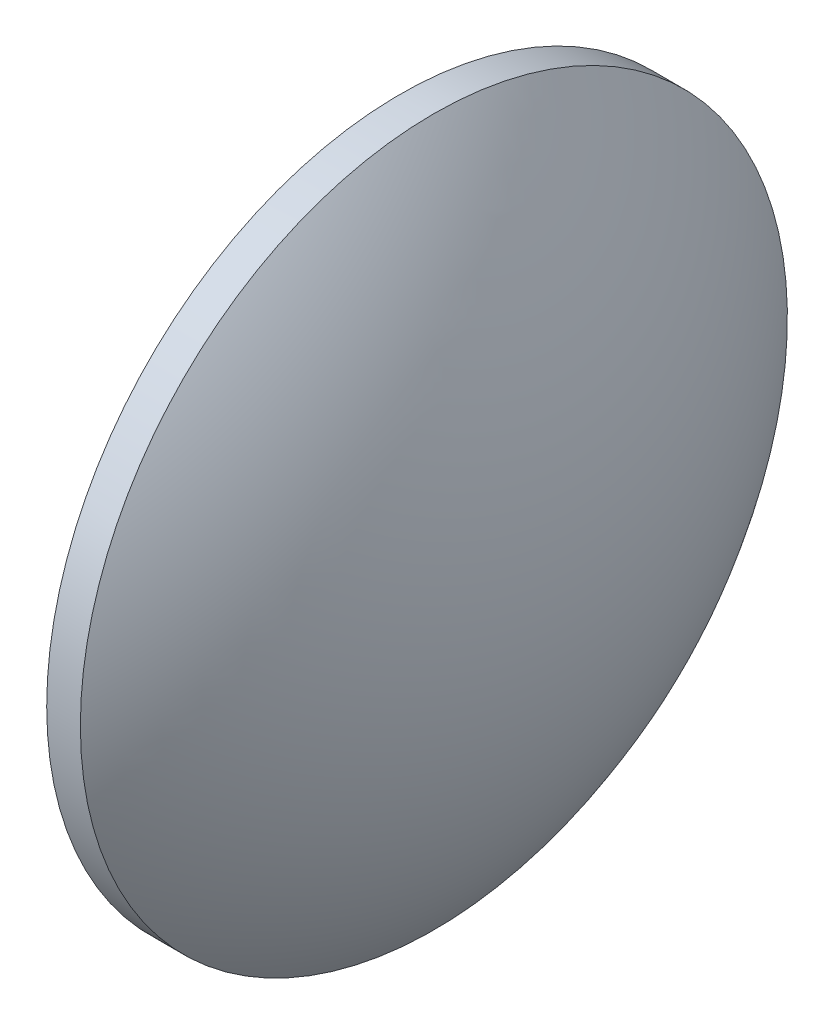
ISO-10303-21;
HEADER;
FILE_DESCRIPTION(('STEP AP214'),'2;1');
FILE_NAME('part.step','',(''),(''),'','','');
FILE_SCHEMA(('AUTOMOTIVE_DESIGN { 1 0 10303 214 1 1 1 1 }'));
ENDSEC;
DATA;
#1=APPLICATION_CONTEXT('core data for automotive mechanical design processes');
#2=APPLICATION_PROTOCOL_DEFINITION('international standard','automotive_design',2000,#1);
#3=PRODUCT_CONTEXT('',#1,'mechanical');
#4=PRODUCT('Part','Part','',(#3));
#5=PRODUCT_RELATED_PRODUCT_CATEGORY('part','',(#4));
#6=PRODUCT_DEFINITION_FORMATION('','',#4);
#7=PRODUCT_DEFINITION_CONTEXT('part definition',#1,'design');
#8=PRODUCT_DEFINITION('design','',#6,#7);
#9=PRODUCT_DEFINITION_SHAPE('','',#8);
#10=(LENGTH_UNIT() NAMED_UNIT(*) SI_UNIT(.MILLI.,.METRE.));
#11=(NAMED_UNIT(*) PLANE_ANGLE_UNIT() SI_UNIT($,.RADIAN.));
#12=(NAMED_UNIT(*) SI_UNIT($,.STERADIAN.) SOLID_ANGLE_UNIT());
#13=UNCERTAINTY_MEASURE_WITH_UNIT(LENGTH_MEASURE(1.E-05),#10,'distance_accuracy_value','');
#14=(GEOMETRIC_REPRESENTATION_CONTEXT(3) GLOBAL_UNCERTAINTY_ASSIGNED_CONTEXT((#13)) GLOBAL_UNIT_ASSIGNED_CONTEXT((#10,
#11,#12)) REPRESENTATION_CONTEXT('',''));
#15=CARTESIAN_POINT('',(0.,0.,0.));
#16=DIRECTION('',(0.,0.,1.));
#17=DIRECTION('',(1.,0.,0.));
#18=AXIS2_PLACEMENT_3D('',#15,#16,#17);
#19=CARTESIAN_POINT('',(347.780816222916,17.7316633986876,0.));
#20=DIRECTION('',(-1.,0.,0.));
#21=DIRECTION('',(0.,1.,0.));
#22=AXIS2_PLACEMENT_3D('',#19,#20,#21);
#23=SPHERICAL_SURFACE('',#22,51.6403171641791);
#24=CARTESIAN_POINT('',(388.701133387095,17.7316633986876,0.));
#25=DIRECTION('',(-1.,0.,0.));
#26=DIRECTION('',(0.,0.,1.));
#27=AXIS2_PLACEMENT_3D('',#24,#25,#26);
#28=CIRCLE('',#27,31.5);
#29=CARTESIAN_POINT('',(388.701133387095,17.7316633986876,31.5));
#30=VERTEX_POINT('',#29);
#31=EDGE_CURVE('E10',#30,#30,#28,.T.);
#32=ORIENTED_EDGE('',*,*,#31,.F.);
#33=EDGE_LOOP('',(#32));
#34=FACE_BOUND('',#33,.T.);
#35=ADVANCED_FACE('F33',(#34),#23,.T.);
#36=CARTESIAN_POINT('',(366.662178325273,17.7316633986876,0.));
#37=DIRECTION('',(-1.,0.,0.));
#38=DIRECTION('',(0.,0.,1.));
#39=AXIS2_PLACEMENT_3D('',#36,#37,#38);
#40=CYLINDRICAL_SURFACE('',#39,31.5);
#41=CARTESIAN_POINT('',(385.701133387095,17.7316633986876,0.));
#42=DIRECTION('',(-1.,0.,0.));
#43=DIRECTION('',(0.,0.,1.));
#44=AXIS2_PLACEMENT_3D('',#41,#42,#43);
#45=CIRCLE('',#44,31.5);
#46=CARTESIAN_POINT('',(385.701133387095,17.7316633986876,31.5));
#47=VERTEX_POINT('',#46);
#48=EDGE_CURVE('E39',#47,#47,#45,.T.);
#49=ORIENTED_EDGE('',*,*,#48,.F.);
#50=EDGE_LOOP('',(#49));
#51=FACE_BOUND('',#50,.T.);
#52=ORIENTED_EDGE('',*,*,#31,.T.);
#53=EDGE_LOOP('',(#52));
#54=FACE_BOUND('',#53,.T.);
#55=ADVANCED_FACE('F47',(#51,#54),#40,.T.);
#56=CARTESIAN_POINT('',(385.701133387095,17.7316633986876,0.));
#57=DIRECTION('',(1.,0.,0.));
#58=DIRECTION('',(0.,0.,-1.));
#59=AXIS2_PLACEMENT_3D('',#56,#57,#58);
#60=PLANE('',#59);
#61=ORIENTED_EDGE('',*,*,#48,.T.);
#62=EDGE_LOOP('',(#61));
#63=FACE_BOUND('',#62,.T.);
#64=ADVANCED_FACE('F45',(#63),#60,.F.);
#65=CLOSED_SHELL('',(#35,#55,#64));
#66=MANIFOLD_SOLID_BREP('B2',#65);
#67=ADVANCED_BREP_SHAPE_REPRESENTATION('',(#18,#66),#14);
#68=SHAPE_DEFINITION_REPRESENTATION(#9,#67);
ENDSEC;
END-ISO-10303-21;
